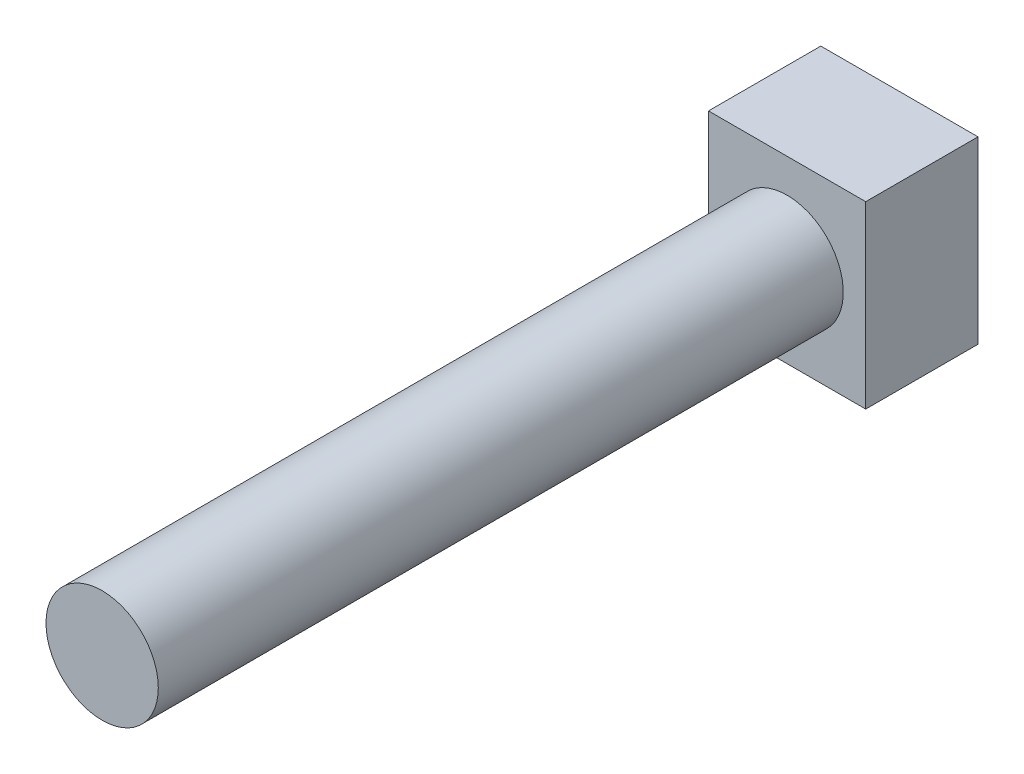
ISO-10303-21;
HEADER;
FILE_DESCRIPTION(('STEP AP214'),'2;1');
FILE_NAME('part.step','',(''),(''),'','','');
FILE_SCHEMA(('AUTOMOTIVE_DESIGN { 1 0 10303 214 1 1 1 1 }'));
ENDSEC;
DATA;
#1=APPLICATION_CONTEXT('core data for automotive mechanical design processes');
#2=APPLICATION_PROTOCOL_DEFINITION('international standard','automotive_design',2000,#1);
#3=PRODUCT_CONTEXT('',#1,'mechanical');
#4=PRODUCT('Part','Part','',(#3));
#5=PRODUCT_RELATED_PRODUCT_CATEGORY('part','',(#4));
#6=PRODUCT_DEFINITION_FORMATION('','',#4);
#7=PRODUCT_DEFINITION_CONTEXT('part definition',#1,'design');
#8=PRODUCT_DEFINITION('design','',#6,#7);
#9=PRODUCT_DEFINITION_SHAPE('','',#8);
#10=(LENGTH_UNIT() NAMED_UNIT(*) SI_UNIT(.MILLI.,.METRE.));
#11=(NAMED_UNIT(*) PLANE_ANGLE_UNIT() SI_UNIT($,.RADIAN.));
#12=(NAMED_UNIT(*) SI_UNIT($,.STERADIAN.) SOLID_ANGLE_UNIT());
#13=UNCERTAINTY_MEASURE_WITH_UNIT(LENGTH_MEASURE(1.E-05),#10,'distance_accuracy_value','');
#14=(GEOMETRIC_REPRESENTATION_CONTEXT(3) GLOBAL_UNCERTAINTY_ASSIGNED_CONTEXT((#13)) GLOBAL_UNIT_ASSIGNED_CONTEXT((#10,
#11,#12)) REPRESENTATION_CONTEXT('',''));
#15=CARTESIAN_POINT('',(0.,0.,0.));
#16=DIRECTION('',(0.,0.,1.));
#17=DIRECTION('',(1.,0.,0.));
#18=AXIS2_PLACEMENT_3D('',#15,#16,#17);
#19=CARTESIAN_POINT('',(0.,0.,35.5));
#20=DIRECTION('',(0.,0.,-1.));
#21=DIRECTION('',(-1.,0.,0.));
#22=AXIS2_PLACEMENT_3D('',#19,#20,#21);
#23=CYLINDRICAL_SURFACE('',#22,2.5);
#24=CARTESIAN_POINT('',(0.,0.,35.5));
#25=DIRECTION('',(0.,0.,1.));
#26=DIRECTION('',(1.,0.,0.));
#27=AXIS2_PLACEMENT_3D('',#24,#25,#26);
#28=CIRCLE('',#27,2.5);
#29=CARTESIAN_POINT('',(2.5,0.,35.5));
#30=VERTEX_POINT('',#29);
#31=EDGE_CURVE('E40',#30,#30,#28,.T.);
#32=ORIENTED_EDGE('',*,*,#31,.F.);
#33=EDGE_LOOP('',(#32));
#34=FACE_BOUND('',#33,.T.);
#35=CARTESIAN_POINT('',(0.,0.,5.));
#36=DIRECTION('',(0.,0.,-1.));
#37=DIRECTION('',(-1.,0.,0.));
#38=AXIS2_PLACEMENT_3D('',#35,#36,#37);
#39=CIRCLE('',#38,2.5);
#40=CARTESIAN_POINT('',(-2.5,0.,5.));
#41=VERTEX_POINT('',#40);
#42=EDGE_CURVE('E11',#41,#41,#39,.T.);
#43=ORIENTED_EDGE('',*,*,#42,.F.);
#44=EDGE_LOOP('',(#43));
#45=FACE_BOUND('',#44,.T.);
#46=ADVANCED_FACE('F32',(#34,#45),#23,.T.);
#47=CARTESIAN_POINT('',(0.,0.,35.5));
#48=DIRECTION('',(0.,0.,1.));
#49=DIRECTION('',(1.,0.,0.));
#50=AXIS2_PLACEMENT_3D('',#47,#48,#49);
#51=PLANE('',#50);
#52=ORIENTED_EDGE('',*,*,#31,.T.);
#53=EDGE_LOOP('',(#52));
#54=FACE_BOUND('',#53,.T.);
#55=ADVANCED_FACE('F112',(#54),#51,.T.);
#56=CARTESIAN_POINT('',(-3.5,4.,5.));
#57=DIRECTION('',(-1.,0.,0.));
#58=DIRECTION('',(0.,-1.,0.));
#59=AXIS2_PLACEMENT_3D('',#56,#57,#58);
#60=PLANE('',#59);
#61=DIRECTION('',(0.,1.,0.));
#62=VECTOR('',#61,1.);
#63=CARTESIAN_POINT('',(-3.5,4.,0.));
#64=LINE('',#63,#62);
#65=CARTESIAN_POINT('',(-3.5,-4.,0.));
#66=VERTEX_POINT('',#65);
#67=CARTESIAN_POINT('',(-3.5,4.,0.));
#68=VERTEX_POINT('',#67);
#69=EDGE_CURVE('E99',#66,#68,#64,.T.);
#70=ORIENTED_EDGE('',*,*,#69,.F.);
#71=DIRECTION('',(0.,0.,-1.));
#72=VECTOR('',#71,1.);
#73=CARTESIAN_POINT('',(-3.5,-4.,5.));
#74=LINE('',#73,#72);
#75=CARTESIAN_POINT('',(-3.5,-4.,5.));
#76=VERTEX_POINT('',#75);
#77=EDGE_CURVE('E48',#76,#66,#74,.T.);
#78=ORIENTED_EDGE('',*,*,#77,.F.);
#79=DIRECTION('',(0.,1.,0.));
#80=VECTOR('',#79,1.);
#81=CARTESIAN_POINT('',(-3.5,4.,5.));
#82=LINE('',#81,#80);
#83=CARTESIAN_POINT('',(-3.5,4.,5.));
#84=VERTEX_POINT('',#83);
#85=EDGE_CURVE('E93',#76,#84,#82,.T.);
#86=ORIENTED_EDGE('',*,*,#85,.T.);
#87=DIRECTION('',(0.,0.,-1.));
#88=VECTOR('',#87,1.);
#89=CARTESIAN_POINT('',(-3.5,4.,5.));
#90=LINE('',#89,#88);
#91=EDGE_CURVE('E76',#84,#68,#90,.T.);
#92=ORIENTED_EDGE('',*,*,#91,.T.);
#93=EDGE_LOOP('',(#70,#78,#86,#92));
#94=FACE_BOUND('',#93,.T.);
#95=ADVANCED_FACE('F131',(#94),#60,.T.);
#96=CARTESIAN_POINT('',(3.5,-4.,5.));
#97=DIRECTION('',(0.,-1.,0.));
#98=DIRECTION('',(0.,0.,-1.));
#99=AXIS2_PLACEMENT_3D('',#96,#97,#98);
#100=PLANE('',#99);
#101=DIRECTION('',(-1.,0.,0.));
#102=VECTOR('',#101,1.);
#103=CARTESIAN_POINT('',(3.5,-4.,0.));
#104=LINE('',#103,#102);
#105=CARTESIAN_POINT('',(3.5,-4.,0.));
#106=VERTEX_POINT('',#105);
#107=EDGE_CURVE('E95',#106,#66,#104,.T.);
#108=ORIENTED_EDGE('',*,*,#107,.F.);
#109=DIRECTION('',(0.,0.,-1.));
#110=VECTOR('',#109,1.);
#111=CARTESIAN_POINT('',(3.5,-4.,5.));
#112=LINE('',#111,#110);
#113=CARTESIAN_POINT('',(3.5,-4.,5.));
#114=VERTEX_POINT('',#113);
#115=EDGE_CURVE('E65',#114,#106,#112,.T.);
#116=ORIENTED_EDGE('',*,*,#115,.F.);
#117=DIRECTION('',(-1.,0.,0.));
#118=VECTOR('',#117,1.);
#119=CARTESIAN_POINT('',(3.5,-4.,5.));
#120=LINE('',#119,#118);
#121=EDGE_CURVE('E90',#114,#76,#120,.T.);
#122=ORIENTED_EDGE('',*,*,#121,.T.);
#123=ORIENTED_EDGE('',*,*,#77,.T.);
#124=EDGE_LOOP('',(#108,#116,#122,#123));
#125=FACE_BOUND('',#124,.T.);
#126=ADVANCED_FACE('F128',(#125),#100,.T.);
#127=CARTESIAN_POINT('',(3.5,4.,5.));
#128=DIRECTION('',(1.,0.,0.));
#129=DIRECTION('',(0.,1.,0.));
#130=AXIS2_PLACEMENT_3D('',#127,#128,#129);
#131=PLANE('',#130);
#132=DIRECTION('',(0.,-1.,0.));
#133=VECTOR('',#132,1.);
#134=CARTESIAN_POINT('',(3.5,4.,0.));
#135=LINE('',#134,#133);
#136=CARTESIAN_POINT('',(3.5,4.,0.));
#137=VERTEX_POINT('',#136);
#138=EDGE_CURVE('E84',#137,#106,#135,.T.);
#139=ORIENTED_EDGE('',*,*,#138,.F.);
#140=DIRECTION('',(0.,0.,-1.));
#141=VECTOR('',#140,1.);
#142=CARTESIAN_POINT('',(3.5,4.,5.));
#143=LINE('',#142,#141);
#144=CARTESIAN_POINT('',(3.5,4.,5.));
#145=VERTEX_POINT('',#144);
#146=EDGE_CURVE('E79',#145,#137,#143,.T.);
#147=ORIENTED_EDGE('',*,*,#146,.F.);
#148=DIRECTION('',(0.,-1.,0.));
#149=VECTOR('',#148,1.);
#150=CARTESIAN_POINT('',(3.5,4.,5.));
#151=LINE('',#150,#149);
#152=EDGE_CURVE('E82',#145,#114,#151,.T.);
#153=ORIENTED_EDGE('',*,*,#152,.T.);
#154=ORIENTED_EDGE('',*,*,#115,.T.);
#155=EDGE_LOOP('',(#139,#147,#153,#154));
#156=FACE_BOUND('',#155,.T.);
#157=ADVANCED_FACE('F81',(#156),#131,.T.);
#158=CARTESIAN_POINT('',(3.5,4.,5.));
#159=DIRECTION('',(0.,1.,0.));
#160=DIRECTION('',(0.,0.,1.));
#161=AXIS2_PLACEMENT_3D('',#158,#159,#160);
#162=PLANE('',#161);
#163=DIRECTION('',(1.,0.,0.));
#164=VECTOR('',#163,1.);
#165=CARTESIAN_POINT('',(3.5,4.,0.));
#166=LINE('',#165,#164);
#167=EDGE_CURVE('E102',#68,#137,#166,.T.);
#168=ORIENTED_EDGE('',*,*,#167,.F.);
#169=ORIENTED_EDGE('',*,*,#91,.F.);
#170=DIRECTION('',(1.,0.,0.));
#171=VECTOR('',#170,1.);
#172=CARTESIAN_POINT('',(3.5,4.,5.));
#173=LINE('',#172,#171);
#174=EDGE_CURVE('E89',#84,#145,#173,.T.);
#175=ORIENTED_EDGE('',*,*,#174,.T.);
#176=ORIENTED_EDGE('',*,*,#146,.T.);
#177=EDGE_LOOP('',(#168,#169,#175,#176));
#178=FACE_BOUND('',#177,.T.);
#179=ADVANCED_FACE('F92',(#178),#162,.T.);
#180=CARTESIAN_POINT('',(0.,0.,5.));
#181=DIRECTION('',(0.,0.,-1.));
#182=DIRECTION('',(-1.,0.,0.));
#183=AXIS2_PLACEMENT_3D('',#180,#181,#182);
#184=PLANE('',#183);
#185=ORIENTED_EDGE('',*,*,#42,.T.);
#186=EDGE_LOOP('',(#185));
#187=FACE_BOUND('',#186,.T.);
#188=ORIENTED_EDGE('',*,*,#85,.F.);
#189=ORIENTED_EDGE('',*,*,#121,.F.);
#190=ORIENTED_EDGE('',*,*,#152,.F.);
#191=ORIENTED_EDGE('',*,*,#174,.F.);
#192=EDGE_LOOP('',(#188,#189,#190,#191));
#193=FACE_BOUND('',#192,.T.);
#194=ADVANCED_FACE('F88',(#187,#193),#184,.F.);
#195=CARTESIAN_POINT('',(0.,0.,0.));
#196=DIRECTION('',(0.,0.,1.));
#197=DIRECTION('',(1.,0.,0.));
#198=AXIS2_PLACEMENT_3D('',#195,#196,#197);
#199=PLANE('',#198);
#200=ORIENTED_EDGE('',*,*,#69,.T.);
#201=ORIENTED_EDGE('',*,*,#167,.T.);
#202=ORIENTED_EDGE('',*,*,#138,.T.);
#203=ORIENTED_EDGE('',*,*,#107,.T.);
#204=EDGE_LOOP('',(#200,#201,#202,#203));
#205=FACE_BOUND('',#204,.T.);
#206=ADVANCED_FACE('F119',(#205),#199,.F.);
#207=CLOSED_SHELL('',(#46,#55,#95,#126,#157,#179,#194,#206));
#208=MANIFOLD_SOLID_BREP('B2',#207);
#209=ADVANCED_BREP_SHAPE_REPRESENTATION('',(#18,#208),#14);
#210=SHAPE_DEFINITION_REPRESENTATION(#9,#209);
ENDSEC;
END-ISO-10303-21;
